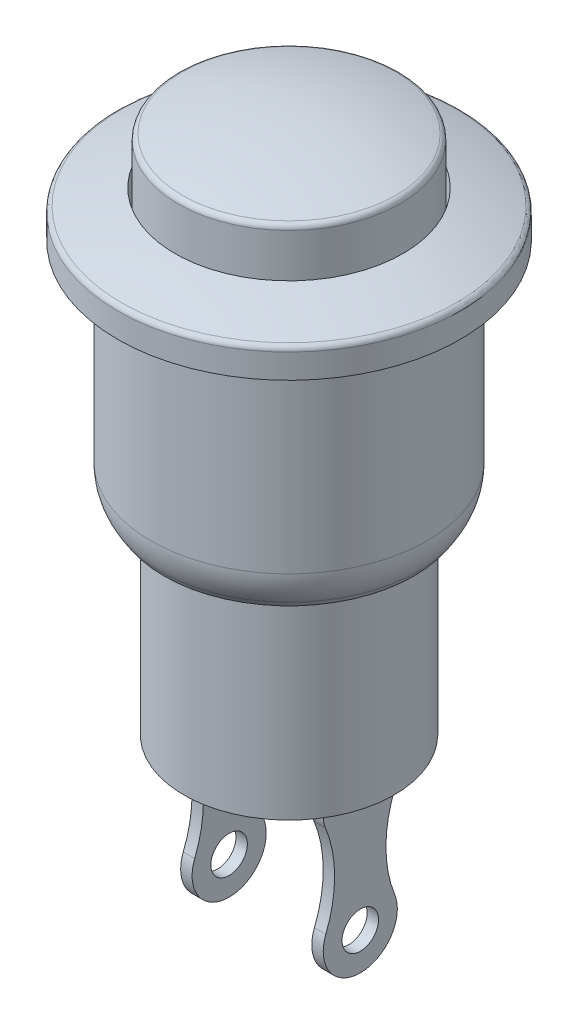
ISO-10303-21;
HEADER;
FILE_DESCRIPTION(('STEP AP214'),'2;1');
FILE_NAME('part.step','',(''),(''),'','','');
FILE_SCHEMA(('AUTOMOTIVE_DESIGN { 1 0 10303 214 1 1 1 1 }'));
ENDSEC;
DATA;
#1=APPLICATION_CONTEXT('core data for automotive mechanical design processes');
#2=APPLICATION_PROTOCOL_DEFINITION('international standard','automotive_design',2000,#1);
#3=PRODUCT_CONTEXT('',#1,'mechanical');
#4=PRODUCT('Part','Part','',(#3));
#5=PRODUCT_RELATED_PRODUCT_CATEGORY('part','',(#4));
#6=PRODUCT_DEFINITION_FORMATION('','',#4);
#7=PRODUCT_DEFINITION_CONTEXT('part definition',#1,'design');
#8=PRODUCT_DEFINITION('design','',#6,#7);
#9=PRODUCT_DEFINITION_SHAPE('','',#8);
#10=(LENGTH_UNIT() NAMED_UNIT(*) SI_UNIT(.MILLI.,.METRE.));
#11=(NAMED_UNIT(*) PLANE_ANGLE_UNIT() SI_UNIT($,.RADIAN.));
#12=(NAMED_UNIT(*) SI_UNIT($,.STERADIAN.) SOLID_ANGLE_UNIT());
#13=UNCERTAINTY_MEASURE_WITH_UNIT(LENGTH_MEASURE(1.E-05),#10,'distance_accuracy_value','');
#14=(GEOMETRIC_REPRESENTATION_CONTEXT(3) GLOBAL_UNCERTAINTY_ASSIGNED_CONTEXT((#13)) GLOBAL_UNIT_ASSIGNED_CONTEXT((#10,
#11,#12)) REPRESENTATION_CONTEXT('',''));
#15=CARTESIAN_POINT('',(0.,0.,0.));
#16=DIRECTION('',(0.,0.,1.));
#17=DIRECTION('',(1.,0.,0.));
#18=AXIS2_PLACEMENT_3D('',#15,#16,#17);
#19=CARTESIAN_POINT('',(-2.5,-6.,-1.3));
#20=DIRECTION('',(0.,0.,1.));
#21=DIRECTION('',(1.,0.,0.));
#22=AXIS2_PLACEMENT_3D('',#19,#20,#21);
#23=PLANE('',#22);
#24=DIRECTION('',(0.,1.,0.));
#25=VECTOR('',#24,1.);
#26=CARTESIAN_POINT('',(-2.1,-6.,-1.3));
#27=LINE('',#26,#25);
#28=CARTESIAN_POINT('',(-2.1,-0.59175240236366,-1.3));
#29=VERTEX_POINT('',#28);
#30=CARTESIAN_POINT('',(-2.1,0.,-1.3));
#31=VERTEX_POINT('',#30);
#32=EDGE_CURVE('E244',#29,#31,#27,.T.);
#33=ORIENTED_EDGE('',*,*,#32,.F.);
#34=DIRECTION('',(-1.,0.,0.));
#35=VECTOR('',#34,1.);
#36=CARTESIAN_POINT('',(-2.5,-0.59175240236366,-1.3));
#37=LINE('',#36,#35);
#38=CARTESIAN_POINT('',(-2.5,-0.59175240236366,-1.3));
#39=VERTEX_POINT('',#38);
#40=EDGE_CURVE('E49',#29,#39,#37,.T.);
#41=ORIENTED_EDGE('',*,*,#40,.T.);
#42=DIRECTION('',(0.,1.,0.));
#43=VECTOR('',#42,1.);
#44=CARTESIAN_POINT('',(-2.5,-6.,-1.3));
#45=LINE('',#44,#43);
#46=CARTESIAN_POINT('',(-2.5,0.,-1.3));
#47=VERTEX_POINT('',#46);
#48=EDGE_CURVE('E246',#39,#47,#45,.T.);
#49=ORIENTED_EDGE('',*,*,#48,.T.);
#50=DIRECTION('',(1.,0.,0.));
#51=VECTOR('',#50,1.);
#52=CARTESIAN_POINT('',(-2.5,0.,-1.3));
#53=LINE('',#52,#51);
#54=EDGE_CURVE('E231',#47,#31,#53,.T.);
#55=ORIENTED_EDGE('',*,*,#54,.T.);
#56=EDGE_LOOP('',(#33,#41,#49,#55));
#57=FACE_BOUND('',#56,.T.);
#58=ADVANCED_FACE('F41',(#57),#23,.F.);
#59=CARTESIAN_POINT('',(2.5,-6.,-1.3));
#60=DIRECTION('',(0.,0.,1.));
#61=DIRECTION('',(1.,0.,0.));
#62=AXIS2_PLACEMENT_3D('',#59,#60,#61);
#63=PLANE('',#62);
#64=DIRECTION('',(0.,1.,0.));
#65=VECTOR('',#64,1.);
#66=CARTESIAN_POINT('',(2.5,-6.,-1.3));
#67=LINE('',#66,#65);
#68=CARTESIAN_POINT('',(2.5,-0.59175240236366,-1.3));
#69=VERTEX_POINT('',#68);
#70=CARTESIAN_POINT('',(2.5,0.,-1.3));
#71=VERTEX_POINT('',#70);
#72=EDGE_CURVE('E222',#69,#71,#67,.T.);
#73=ORIENTED_EDGE('',*,*,#72,.F.);
#74=DIRECTION('',(-1.,0.,0.));
#75=VECTOR('',#74,1.);
#76=CARTESIAN_POINT('',(2.5,-0.59175240236366,-1.3));
#77=LINE('',#76,#75);
#78=CARTESIAN_POINT('',(2.1,-0.59175240236366,-1.3));
#79=VERTEX_POINT('',#78);
#80=EDGE_CURVE('E320',#69,#79,#77,.T.);
#81=ORIENTED_EDGE('',*,*,#80,.T.);
#82=DIRECTION('',(0.,1.,0.));
#83=VECTOR('',#82,1.);
#84=CARTESIAN_POINT('',(2.1,-6.,-1.3));
#85=LINE('',#84,#83);
#86=CARTESIAN_POINT('',(2.1,0.,-1.3));
#87=VERTEX_POINT('',#86);
#88=EDGE_CURVE('E224',#79,#87,#85,.T.);
#89=ORIENTED_EDGE('',*,*,#88,.T.);
#90=DIRECTION('',(1.,0.,0.));
#91=VECTOR('',#90,1.);
#92=CARTESIAN_POINT('',(2.5,0.,-1.3));
#93=LINE('',#92,#91);
#94=EDGE_CURVE('E214',#87,#71,#93,.T.);
#95=ORIENTED_EDGE('',*,*,#94,.T.);
#96=EDGE_LOOP('',(#73,#81,#89,#95));
#97=FACE_BOUND('',#96,.T.);
#98=ADVANCED_FACE('F358',(#97),#63,.F.);
#99=CARTESIAN_POINT('',(0.,0.,0.));
#100=DIRECTION('',(0.,-1.,0.));
#101=DIRECTION('',(0.,0.,-1.));
#102=AXIS2_PLACEMENT_3D('',#99,#100,#101);
#103=PLANE('',#102);
#104=ORIENTED_EDGE('',*,*,#54,.F.);
#105=DIRECTION('',(0.,0.,-1.));
#106=VECTOR('',#105,1.);
#107=CARTESIAN_POINT('',(-2.5,0.,1.3));
#108=LINE('',#107,#106);
#109=CARTESIAN_POINT('',(-2.5,0.,1.3));
#110=VERTEX_POINT('',#109);
#111=EDGE_CURVE('E228',#110,#47,#108,.T.);
#112=ORIENTED_EDGE('',*,*,#111,.F.);
#113=DIRECTION('',(-1.,0.,0.));
#114=VECTOR('',#113,1.);
#115=CARTESIAN_POINT('',(-2.5,0.,1.3));
#116=LINE('',#115,#114);
#117=CARTESIAN_POINT('',(-2.1,0.,1.3));
#118=VERTEX_POINT('',#117);
#119=EDGE_CURVE('E237',#118,#110,#116,.T.);
#120=ORIENTED_EDGE('',*,*,#119,.F.);
#121=DIRECTION('',(0.,0.,1.));
#122=VECTOR('',#121,1.);
#123=CARTESIAN_POINT('',(-2.1,0.,1.3));
#124=LINE('',#123,#122);
#125=EDGE_CURVE('E234',#31,#118,#124,.T.);
#126=ORIENTED_EDGE('',*,*,#125,.F.);
#127=EDGE_LOOP('',(#104,#112,#120,#126));
#128=FACE_BOUND('',#127,.T.);
#129=CARTESIAN_POINT('',(0.,0.,0.));
#130=DIRECTION('',(0.,-1.,0.));
#131=DIRECTION('',(0.,0.,-1.));
#132=AXIS2_PLACEMENT_3D('',#129,#130,#131);
#133=CIRCLE('',#132,3.69);
#134=CARTESIAN_POINT('',(0.,0.,-3.69));
#135=VERTEX_POINT('',#134);
#136=EDGE_CURVE('E257',#135,#135,#133,.T.);
#137=ORIENTED_EDGE('',*,*,#136,.T.);
#138=EDGE_LOOP('',(#137));
#139=FACE_BOUND('',#138,.T.);
#140=DIRECTION('',(0.,0.,-1.));
#141=VECTOR('',#140,1.);
#142=CARTESIAN_POINT('',(2.1,0.,1.3));
#143=LINE('',#142,#141);
#144=CARTESIAN_POINT('',(2.1,0.,1.3));
#145=VERTEX_POINT('',#144);
#146=EDGE_CURVE('E211',#145,#87,#143,.T.);
#147=ORIENTED_EDGE('',*,*,#146,.F.);
#148=DIRECTION('',(-1.,0.,0.));
#149=VECTOR('',#148,1.);
#150=CARTESIAN_POINT('',(2.5,0.,1.3));
#151=LINE('',#150,#149);
#152=CARTESIAN_POINT('',(2.5,0.,1.3));
#153=VERTEX_POINT('',#152);
#154=EDGE_CURVE('E208',#153,#145,#151,.T.);
#155=ORIENTED_EDGE('',*,*,#154,.F.);
#156=DIRECTION('',(0.,0.,1.));
#157=VECTOR('',#156,1.);
#158=CARTESIAN_POINT('',(2.5,0.,1.3));
#159=LINE('',#158,#157);
#160=EDGE_CURVE('E217',#71,#153,#159,.T.);
#161=ORIENTED_EDGE('',*,*,#160,.F.);
#162=ORIENTED_EDGE('',*,*,#94,.F.);
#163=EDGE_LOOP('',(#147,#155,#161,#162));
#164=FACE_BOUND('',#163,.T.);
#165=ADVANCED_FACE('F335',(#128,#139,#164),#103,.T.);
#166=CARTESIAN_POINT('',(0.,0.,0.));
#167=DIRECTION('',(0.,-1.,0.));
#168=DIRECTION('',(0.,0.,-1.));
#169=AXIS2_PLACEMENT_3D('',#166,#167,#168);
#170=CYLINDRICAL_SURFACE('',#169,6.01);
#171=CARTESIAN_POINT('',(0.,15.8594915447855,0.));
#172=DIRECTION('',(0.,-1.,0.));
#173=DIRECTION('',(0.,0.,-1.));
#174=AXIS2_PLACEMENT_3D('',#171,#172,#173);
#175=CIRCLE('',#174,6.01);
#176=CARTESIAN_POINT('',(0.,15.8594915447855,-6.01));
#177=VERTEX_POINT('',#176);
#178=EDGE_CURVE('E275',#177,#177,#175,.T.);
#179=ORIENTED_EDGE('',*,*,#178,.T.);
#180=EDGE_LOOP('',(#179));
#181=FACE_BOUND('',#180,.T.);
#182=CARTESIAN_POINT('',(0.,15.,0.));
#183=DIRECTION('',(0.,-1.,0.));
#184=DIRECTION('',(0.,0.,-1.));
#185=AXIS2_PLACEMENT_3D('',#182,#183,#184);
#186=CIRCLE('',#185,6.01);
#187=CARTESIAN_POINT('',(0.,15.,-6.01));
#188=VERTEX_POINT('',#187);
#189=EDGE_CURVE('E248',#188,#188,#186,.T.);
#190=ORIENTED_EDGE('',*,*,#189,.F.);
#191=EDGE_LOOP('',(#190));
#192=FACE_BOUND('',#191,.T.);
#193=ADVANCED_FACE('F390',(#181,#192),#170,.T.);
#194=CARTESIAN_POINT('',(0.,-0.466749999999985,0.));
#195=DIRECTION('',(0.,-1.,0.));
#196=DIRECTION('',(1.,0.,0.));
#197=AXIS2_PLACEMENT_3D('',#194,#195,#196);
#198=SPHERICAL_SURFACE('',#197,17.5292314595506);
#199=CARTESIAN_POINT('',(0.,16.0479158448809,0.));
#200=DIRECTION('',(0.,-1.,0.));
#201=DIRECTION('',(0.,0.,-1.));
#202=AXIS2_PLACEMENT_3D('',#199,#200,#201);
#203=CIRCLE('',#202,5.87705432971521);
#204=CARTESIAN_POINT('',(0.,16.0479158448809,-5.87705432971521));
#205=VERTEX_POINT('',#204);
#206=EDGE_CURVE('E278',#205,#205,#203,.F.);
#207=ORIENTED_EDGE('',*,*,#206,.T.);
#208=EDGE_LOOP('',(#207));
#209=FACE_BOUND('',#208,.T.);
#210=CARTESIAN_POINT('',(0.,16.6,0.));
#211=DIRECTION('',(0.,-1.,0.));
#212=DIRECTION('',(0.,0.,-1.));
#213=AXIS2_PLACEMENT_3D('',#210,#211,#212);
#214=CIRCLE('',#213,4.);
#215=CARTESIAN_POINT('',(0.,16.6,-4.));
#216=VERTEX_POINT('',#215);
#217=EDGE_CURVE('E266',#216,#216,#214,.T.);
#218=ORIENTED_EDGE('',*,*,#217,.T.);
#219=EDGE_LOOP('',(#218));
#220=FACE_BOUND('',#219,.T.);
#221=ADVANCED_FACE('F405',(#209,#220),#198,.T.);
#222=CARTESIAN_POINT('',(0.,0.,0.));
#223=DIRECTION('',(0.,-1.,0.));
#224=DIRECTION('',(0.,0.,-1.));
#225=AXIS2_PLACEMENT_3D('',#222,#223,#224);
#226=CYLINDRICAL_SURFACE('',#225,4.);
#227=CARTESIAN_POINT('',(0.,15.0131906379404,0.));
#228=DIRECTION('',(0.,-1.,0.));
#229=DIRECTION('',(0.,0.,-1.));
#230=AXIS2_PLACEMENT_3D('',#227,#228,#229);
#231=CIRCLE('',#230,4.);
#232=CARTESIAN_POINT('',(0.,15.0131906379404,-4.));
#233=VERTEX_POINT('',#232);
#234=EDGE_CURVE('E263',#233,#233,#231,.T.);
#235=ORIENTED_EDGE('',*,*,#234,.T.);
#236=EDGE_LOOP('',(#235));
#237=FACE_BOUND('',#236,.T.);
#238=ORIENTED_EDGE('',*,*,#217,.F.);
#239=EDGE_LOOP('',(#238));
#240=FACE_BOUND('',#239,.T.);
#241=ADVANCED_FACE('F401',(#237,#240),#226,.F.);
#242=CARTESIAN_POINT('',(0.,15.0131906379404,0.));
#243=DIRECTION('',(0.,1.,0.));
#244=DIRECTION('',(0.,0.,1.));
#245=AXIS2_PLACEMENT_3D('',#242,#243,#244);
#246=PLANE('',#245);
#247=CARTESIAN_POINT('',(0.,15.0131906379404,0.));
#248=DIRECTION('',(0.,-1.,0.));
#249=DIRECTION('',(0.,0.,-1.));
#250=AXIS2_PLACEMENT_3D('',#247,#248,#249);
#251=CIRCLE('',#250,3.89);
#252=CARTESIAN_POINT('',(0.,15.0131906379404,-3.89));
#253=VERTEX_POINT('',#252);
#254=EDGE_CURVE('E260',#253,#253,#251,.T.);
#255=ORIENTED_EDGE('',*,*,#254,.T.);
#256=EDGE_LOOP('',(#255));
#257=FACE_BOUND('',#256,.T.);
#258=ORIENTED_EDGE('',*,*,#234,.F.);
#259=EDGE_LOOP('',(#258));
#260=FACE_BOUND('',#259,.T.);
#261=ADVANCED_FACE('F397',(#257,#260),#246,.T.);
#262=CARTESIAN_POINT('',(0.,0.,0.));
#263=DIRECTION('',(0.,-1.,0.));
#264=DIRECTION('',(0.,0.,-1.));
#265=AXIS2_PLACEMENT_3D('',#262,#263,#264);
#266=CYLINDRICAL_SURFACE('',#265,3.89);
#267=CARTESIAN_POINT('',(0.,18.0525692696262,0.));
#268=DIRECTION('',(0.,-1.,0.));
#269=DIRECTION('',(0.,0.,-1.));
#270=AXIS2_PLACEMENT_3D('',#267,#268,#269);
#271=CIRCLE('',#270,3.89);
#272=CARTESIAN_POINT('',(0.,18.0525692696262,-3.89));
#273=VERTEX_POINT('',#272);
#274=EDGE_CURVE('E269',#273,#273,#271,.T.);
#275=ORIENTED_EDGE('',*,*,#274,.T.);
#276=EDGE_LOOP('',(#275));
#277=FACE_BOUND('',#276,.T.);
#278=ORIENTED_EDGE('',*,*,#254,.F.);
#279=EDGE_LOOP('',(#278));
#280=FACE_BOUND('',#279,.T.);
#281=ADVANCED_FACE('F393',(#277,#280),#266,.T.);
#282=CARTESIAN_POINT('',(0.,5.88991666666667,0.));
#283=DIRECTION('',(0.,-1.,0.));
#284=DIRECTION('',(1.,0.,0.));
#285=AXIS2_PLACEMENT_3D('',#282,#283,#284);
#286=SPHERICAL_SURFACE('',#285,12.9100833333333);
#287=CARTESIAN_POINT('',(0.,18.2439551525348,0.));
#288=DIRECTION('',(0.,-1.,0.));
#289=DIRECTION('',(0.,0.,-1.));
#290=AXIS2_PLACEMENT_3D('',#287,#288,#289);
#291=CIRCLE('',#290,3.74806413543053);
#292=CARTESIAN_POINT('',(0.,18.2439551525348,-3.74806413543053));
#293=VERTEX_POINT('',#292);
#294=EDGE_CURVE('E272',#293,#293,#291,.F.);
#295=ORIENTED_EDGE('',*,*,#294,.T.);
#296=EDGE_LOOP('',(#295));
#297=FACE_BOUND('',#296,.T.);
#298=ADVANCED_FACE('F386',(#297),#286,.T.);
#299=CARTESIAN_POINT('',(0.,0.,0.));
#300=DIRECTION('',(0.,-1.,0.));
#301=DIRECTION('',(0.,0.,-1.));
#302=AXIS2_PLACEMENT_3D('',#299,#300,#301);
#303=CYLINDRICAL_SURFACE('',#302,3.69);
#304=CARTESIAN_POINT('',(0.,7.,0.));
#305=DIRECTION('',(0.,-1.,0.));
#306=DIRECTION('',(0.,0.,-1.));
#307=AXIS2_PLACEMENT_3D('',#304,#305,#306);
#308=CIRCLE('',#307,3.69);
#309=CARTESIAN_POINT('',(0.,7.,-3.69));
#310=VERTEX_POINT('',#309);
#311=EDGE_CURVE('E254',#310,#310,#308,.T.);
#312=ORIENTED_EDGE('',*,*,#311,.T.);
#313=EDGE_LOOP('',(#312));
#314=FACE_BOUND('',#313,.T.);
#315=ORIENTED_EDGE('',*,*,#136,.F.);
#316=EDGE_LOOP('',(#315));
#317=FACE_BOUND('',#316,.T.);
#318=ADVANCED_FACE('F382',(#314,#317),#303,.T.);
#319=CARTESIAN_POINT('',(0.,7.,0.));
#320=DIRECTION('',(0.,-1.,0.));
#321=DIRECTION('',(0.,0.,-1.));
#322=AXIS2_PLACEMENT_3D('',#319,#320,#321);
#323=PLANE('',#322);
#324=CARTESIAN_POINT('',(0.,7.,0.));
#325=DIRECTION('',(0.,-1.,0.));
#326=DIRECTION('',(0.,0.,-1.));
#327=AXIS2_PLACEMENT_3D('',#324,#325,#326);
#328=CIRCLE('',#327,4.38541468476175);
#329=CARTESIAN_POINT('',(0.,7.,-4.38541468476175));
#330=VERTEX_POINT('',#329);
#331=EDGE_CURVE('E281',#330,#330,#328,.T.);
#332=ORIENTED_EDGE('',*,*,#331,.T.);
#333=EDGE_LOOP('',(#332));
#334=FACE_BOUND('',#333,.T.);
#335=ORIENTED_EDGE('',*,*,#311,.F.);
#336=EDGE_LOOP('',(#335));
#337=FACE_BOUND('',#336,.T.);
#338=ADVANCED_FACE('F378',(#334,#337),#323,.T.);
#339=CARTESIAN_POINT('',(0.,0.,0.));
#340=DIRECTION('',(0.,-1.,0.));
#341=DIRECTION('',(0.,0.,-1.));
#342=AXIS2_PLACEMENT_3D('',#339,#340,#341);
#343=CYLINDRICAL_SURFACE('',#342,4.84);
#344=CARTESIAN_POINT('',(0.,8.29242698992415,0.));
#345=DIRECTION('',(0.,-1.,0.));
#346=DIRECTION('',(0.,0.,-1.));
#347=AXIS2_PLACEMENT_3D('',#344,#345,#346);
#348=CIRCLE('',#347,4.84);
#349=CARTESIAN_POINT('',(0.,8.29242698992415,-4.84));
#350=VERTEX_POINT('',#349);
#351=EDGE_CURVE('E284',#350,#350,#348,.F.);
#352=ORIENTED_EDGE('',*,*,#351,.T.);
#353=EDGE_LOOP('',(#352));
#354=FACE_BOUND('',#353,.T.);
#355=CARTESIAN_POINT('',(0.,15.,0.));
#356=DIRECTION('',(0.,-1.,0.));
#357=DIRECTION('',(0.,0.,-1.));
#358=AXIS2_PLACEMENT_3D('',#355,#356,#357);
#359=CIRCLE('',#358,4.84);
#360=CARTESIAN_POINT('',(0.,15.,-4.84));
#361=VERTEX_POINT('',#360);
#362=EDGE_CURVE('E251',#361,#361,#359,.T.);
#363=ORIENTED_EDGE('',*,*,#362,.T.);
#364=EDGE_LOOP('',(#363));
#365=FACE_BOUND('',#364,.T.);
#366=ADVANCED_FACE('F374',(#354,#365),#343,.T.);
#367=CARTESIAN_POINT('',(0.,15.,0.));
#368=DIRECTION('',(0.,-1.,0.));
#369=DIRECTION('',(0.,0.,-1.));
#370=AXIS2_PLACEMENT_3D('',#367,#368,#369);
#371=PLANE('',#370);
#372=ORIENTED_EDGE('',*,*,#189,.T.);
#373=EDGE_LOOP('',(#372));
#374=FACE_BOUND('',#373,.T.);
#375=ORIENTED_EDGE('',*,*,#362,.F.);
#376=EDGE_LOOP('',(#375));
#377=FACE_BOUND('',#376,.T.);
#378=ADVANCED_FACE('F370',(#374,#377),#371,.T.);
#379=CARTESIAN_POINT('',(0.,18.0525692696262,0.));
#380=DIRECTION('',(0.,-1.,0.));
#381=DIRECTION('',(0.,0.,-1.));
#382=AXIS2_PLACEMENT_3D('',#379,#380,#381);
#383=TOROIDAL_SURFACE('',#382,3.69,0.2);
#384=ORIENTED_EDGE('',*,*,#294,.F.);
#385=EDGE_LOOP('',(#384));
#386=FACE_BOUND('',#385,.T.);
#387=ORIENTED_EDGE('',*,*,#274,.F.);
#388=EDGE_LOOP('',(#387));
#389=FACE_BOUND('',#388,.T.);
#390=ADVANCED_FACE('F373',(#386,#389),#383,.T.);
#391=CARTESIAN_POINT('',(0.,15.8594915447855,0.));
#392=DIRECTION('',(0.,-1.,0.));
#393=DIRECTION('',(0.,0.,-1.));
#394=AXIS2_PLACEMENT_3D('',#391,#392,#393);
#395=TOROIDAL_SURFACE('',#394,5.81,0.2);
#396=ORIENTED_EDGE('',*,*,#206,.F.);
#397=EDGE_LOOP('',(#396));
#398=FACE_BOUND('',#397,.T.);
#399=ORIENTED_EDGE('',*,*,#178,.F.);
#400=EDGE_LOOP('',(#399));
#401=FACE_BOUND('',#400,.T.);
#402=ADVANCED_FACE('F415',(#398,#401),#395,.T.);
#403=CARTESIAN_POINT('',(0.,7.,0.));
#404=DIRECTION('',(0.,1.,0.));
#405=DIRECTION('',(0.,0.,1.));
#406=AXIS2_PLACEMENT_3D('',#403,#404,#405);
#407=CONICAL_SURFACE('',#406,4.38541468476175,0.575958653158124);
#408=CARTESIAN_POINT('',(0.,7.2031489198941,0.));
#409=DIRECTION('',(0.,-1.,0.));
#410=DIRECTION('',(0.,0.,-1.));
#411=AXIS2_PLACEMENT_3D('',#408,#409,#410);
#412=CIRCLE('',#411,4.51734113589085);
#413=CARTESIAN_POINT('',(0.,7.2031489198941,-4.51734113589085));
#414=VERTEX_POINT('',#413);
#415=EDGE_CURVE('E287',#414,#414,#412,.T.);
#416=ORIENTED_EDGE('',*,*,#415,.T.);
#417=EDGE_LOOP('',(#416));
#418=FACE_BOUND('',#417,.T.);
#419=ORIENTED_EDGE('',*,*,#331,.F.);
#420=EDGE_LOOP('',(#419));
#421=FACE_BOUND('',#420,.T.);
#422=ADVANCED_FACE('F419',(#418,#421),#407,.T.);
#423=CARTESIAN_POINT('',(0.,8.29242698992415,0.));
#424=DIRECTION('',(0.,-1.,0.));
#425=DIRECTION('',(0.,0.,-1.));
#426=AXIS2_PLACEMENT_3D('',#423,#424,#425);
#427=TOROIDAL_SURFACE('',#426,2.84,2.);
#428=ORIENTED_EDGE('',*,*,#415,.F.);
#429=EDGE_LOOP('',(#428));
#430=FACE_BOUND('',#429,.T.);
#431=ORIENTED_EDGE('',*,*,#351,.F.);
#432=EDGE_LOOP('',(#431));
#433=FACE_BOUND('',#432,.T.);
#434=ADVANCED_FACE('F368',(#430,#433),#427,.T.);
#435=CARTESIAN_POINT('',(-2.5,-6.,1.3));
#436=DIRECTION('',(1.,0.,0.));
#437=DIRECTION('',(0.,0.,-1.));
#438=AXIS2_PLACEMENT_3D('',#435,#436,#437);
#439=PLANE('',#438);
#440=CARTESIAN_POINT('',(-2.5,-4.7,0.));
#441=DIRECTION('',(-1.,0.,0.));
#442=DIRECTION('',(0.,0.,1.));
#443=AXIS2_PLACEMENT_3D('',#440,#441,#442);
#444=CIRCLE('',#443,0.64);
#445=CARTESIAN_POINT('',(-2.5,-4.7,0.64));
#446=VERTEX_POINT('',#445);
#447=EDGE_CURVE('E198',#446,#446,#444,.T.);
#448=ORIENTED_EDGE('',*,*,#447,.F.);
#449=EDGE_LOOP('',(#448));
#450=FACE_BOUND('',#449,.T.);
#451=CARTESIAN_POINT('',(-2.5,-2.61666666666667,5.22534722222222));
#452=DIRECTION('',(-1.,0.,0.));
#453=DIRECTION('',(0.,0.,-1.));
#454=AXIS2_PLACEMENT_3D('',#451,#452,#453);
#455=CIRCLE('',#454,4.32534722222222);
#456=CARTESIAN_POINT('',(-2.5,-0.971993197903382,1.22488752689574));
#457=VERTEX_POINT('',#456);
#458=CARTESIAN_POINT('',(-2.5,-4.2185482377631,1.20756126165052));
#459=VERTEX_POINT('',#458);
#460=EDGE_CURVE('E155',#457,#459,#455,.T.);
#461=ORIENTED_EDGE('',*,*,#460,.F.);
#462=CARTESIAN_POINT('',(-2.5,-0.591752402363664,0.299999999999999));
#463=DIRECTION('',(1.,0.,0.));
#464=DIRECTION('',(0.,0.,-1.));
#465=AXIS2_PLACEMENT_3D('',#462,#463,#464);
#466=CIRCLE('',#465,1.);
#467=CARTESIAN_POINT('',(-2.5,-0.591752402363664,1.3));
#468=VERTEX_POINT('',#467);
#469=EDGE_CURVE('E313',#457,#468,#466,.F.);
#470=ORIENTED_EDGE('',*,*,#469,.T.);
#471=DIRECTION('',(0.,1.,0.));
#472=VECTOR('',#471,1.);
#473=CARTESIAN_POINT('',(-2.5,-6.,1.3));
#474=LINE('',#473,#472);
#475=EDGE_CURVE('E240',#468,#110,#474,.T.);
#476=ORIENTED_EDGE('',*,*,#475,.T.);
#477=ORIENTED_EDGE('',*,*,#111,.T.);
#478=ORIENTED_EDGE('',*,*,#48,.F.);
#479=CARTESIAN_POINT('',(-2.5,-0.59175240236366,-0.300000000000001));
#480=DIRECTION('',(1.,0.,0.));
#481=DIRECTION('',(0.,0.,-1.));
#482=AXIS2_PLACEMENT_3D('',#479,#480,#481);
#483=CIRCLE('',#482,1.);
#484=CARTESIAN_POINT('',(-2.5,-0.971993197903378,-1.22488752689574));
#485=VERTEX_POINT('',#484);
#486=EDGE_CURVE('E311',#39,#485,#483,.F.);
#487=ORIENTED_EDGE('',*,*,#486,.T.);
#488=CARTESIAN_POINT('',(-2.5,-2.61666666666667,-5.22534722222222));
#489=DIRECTION('',(-1.,0.,0.));
#490=DIRECTION('',(0.,0.,1.));
#491=AXIS2_PLACEMENT_3D('',#488,#489,#490);
#492=CIRCLE('',#491,4.32534722222222);
#493=CARTESIAN_POINT('',(-2.5,-4.2185482377631,-1.20756126165051));
#494=VERTEX_POINT('',#493);
#495=EDGE_CURVE('E169',#494,#485,#492,.T.);
#496=ORIENTED_EDGE('',*,*,#495,.F.);
#497=CARTESIAN_POINT('',(-2.5,-4.7,0.));
#498=DIRECTION('',(1.,0.,0.));
#499=DIRECTION('',(0.,0.,1.));
#500=AXIS2_PLACEMENT_3D('',#497,#498,#499);
#501=CIRCLE('',#500,1.3);
#502=EDGE_CURVE('E164',#459,#494,#501,.T.);
#503=ORIENTED_EDGE('',*,*,#502,.F.);
#504=EDGE_LOOP('',(#461,#470,#476,#477,#478,#487,#496,#503));
#505=FACE_BOUND('',#504,.T.);
#506=ADVANCED_FACE('F168',(#450,#505),#439,.F.);
#507=CARTESIAN_POINT('',(-2.1,-6.,1.3));
#508=DIRECTION('',(-1.,0.,0.));
#509=DIRECTION('',(0.,0.,1.));
#510=AXIS2_PLACEMENT_3D('',#507,#508,#509);
#511=PLANE('',#510);
#512=CARTESIAN_POINT('',(-2.1,-4.7,0.));
#513=DIRECTION('',(-1.,0.,0.));
#514=DIRECTION('',(0.,0.,1.));
#515=AXIS2_PLACEMENT_3D('',#512,#513,#514);
#516=CIRCLE('',#515,0.64);
#517=CARTESIAN_POINT('',(-2.1,-4.7,0.64));
#518=VERTEX_POINT('',#517);
#519=EDGE_CURVE('E205',#518,#518,#516,.T.);
#520=ORIENTED_EDGE('',*,*,#519,.T.);
#521=EDGE_LOOP('',(#520));
#522=FACE_BOUND('',#521,.T.);
#523=DIRECTION('',(0.,1.,0.));
#524=VECTOR('',#523,1.);
#525=CARTESIAN_POINT('',(-2.1,-6.,1.3));
#526=LINE('',#525,#524);
#527=CARTESIAN_POINT('',(-2.1,-0.591752402363664,1.3));
#528=VERTEX_POINT('',#527);
#529=EDGE_CURVE('E242',#528,#118,#526,.T.);
#530=ORIENTED_EDGE('',*,*,#529,.F.);
#531=CARTESIAN_POINT('',(-2.1,-0.591752402363664,0.299999999999999));
#532=DIRECTION('',(-1.,0.,0.));
#533=DIRECTION('',(0.,0.,1.));
#534=AXIS2_PLACEMENT_3D('',#531,#532,#533);
#535=CIRCLE('',#534,1.);
#536=CARTESIAN_POINT('',(-2.1,-0.971993197903382,1.22488752689574));
#537=VERTEX_POINT('',#536);
#538=EDGE_CURVE('E318',#528,#537,#535,.F.);
#539=ORIENTED_EDGE('',*,*,#538,.T.);
#540=CARTESIAN_POINT('',(-2.1,-2.61666666666667,5.22534722222222));
#541=DIRECTION('',(-1.,0.,0.));
#542=DIRECTION('',(0.,0.,1.));
#543=AXIS2_PLACEMENT_3D('',#540,#541,#542);
#544=CIRCLE('',#543,4.32534722222222);
#545=CARTESIAN_POINT('',(-2.1,-4.2185482377631,1.20756126165052));
#546=VERTEX_POINT('',#545);
#547=EDGE_CURVE('E196',#537,#546,#544,.T.);
#548=ORIENTED_EDGE('',*,*,#547,.T.);
#549=CARTESIAN_POINT('',(-2.1,-4.7,0.));
#550=DIRECTION('',(-1.,0.,0.));
#551=DIRECTION('',(0.,0.,1.));
#552=AXIS2_PLACEMENT_3D('',#549,#550,#551);
#553=CIRCLE('',#552,1.3);
#554=CARTESIAN_POINT('',(-2.1,-4.2185482377631,-1.20756126165051));
#555=VERTEX_POINT('',#554);
#556=EDGE_CURVE('E175',#546,#555,#553,.F.);
#557=ORIENTED_EDGE('',*,*,#556,.T.);
#558=CARTESIAN_POINT('',(-2.1,-2.61666666666667,-5.22534722222222));
#559=DIRECTION('',(-1.,0.,0.));
#560=DIRECTION('',(0.,0.,1.));
#561=AXIS2_PLACEMENT_3D('',#558,#559,#560);
#562=CIRCLE('',#561,4.32534722222222);
#563=CARTESIAN_POINT('',(-2.1,-0.971993197903378,-1.22488752689574));
#564=VERTEX_POINT('',#563);
#565=EDGE_CURVE('E191',#555,#564,#562,.T.);
#566=ORIENTED_EDGE('',*,*,#565,.T.);
#567=CARTESIAN_POINT('',(-2.1,-0.59175240236366,-0.300000000000001));
#568=DIRECTION('',(-1.,0.,0.));
#569=DIRECTION('',(0.,0.,1.));
#570=AXIS2_PLACEMENT_3D('',#567,#568,#569);
#571=CIRCLE('',#570,1.);
#572=EDGE_CURVE('E56',#564,#29,#571,.F.);
#573=ORIENTED_EDGE('',*,*,#572,.T.);
#574=ORIENTED_EDGE('',*,*,#32,.T.);
#575=ORIENTED_EDGE('',*,*,#125,.T.);
#576=EDGE_LOOP('',(#530,#539,#548,#557,#566,#573,#574,#575));
#577=FACE_BOUND('',#576,.T.);
#578=ADVANCED_FACE('F338',(#522,#577),#511,.F.);
#579=CARTESIAN_POINT('',(-2.5,-6.,1.3));
#580=DIRECTION('',(0.,0.,-1.));
#581=DIRECTION('',(-1.,0.,0.));
#582=AXIS2_PLACEMENT_3D('',#579,#580,#581);
#583=PLANE('',#582);
#584=ORIENTED_EDGE('',*,*,#475,.F.);
#585=DIRECTION('',(-1.,0.,0.));
#586=VECTOR('',#585,1.);
#587=CARTESIAN_POINT('',(-2.5,-0.591752402363664,1.3));
#588=LINE('',#587,#586);
#589=EDGE_CURVE('E315',#468,#528,#588,.F.);
#590=ORIENTED_EDGE('',*,*,#589,.T.);
#591=ORIENTED_EDGE('',*,*,#529,.T.);
#592=ORIENTED_EDGE('',*,*,#119,.T.);
#593=EDGE_LOOP('',(#584,#590,#591,#592));
#594=FACE_BOUND('',#593,.T.);
#595=ADVANCED_FACE('F344',(#594),#583,.F.);
#596=CARTESIAN_POINT('',(2.5,-6.,1.3));
#597=DIRECTION('',(0.,0.,-1.));
#598=DIRECTION('',(-1.,0.,0.));
#599=AXIS2_PLACEMENT_3D('',#596,#597,#598);
#600=PLANE('',#599);
#601=DIRECTION('',(0.,1.,0.));
#602=VECTOR('',#601,1.);
#603=CARTESIAN_POINT('',(2.1,-6.,1.3));
#604=LINE('',#603,#602);
#605=CARTESIAN_POINT('',(2.1,-0.591752402363664,1.3));
#606=VERTEX_POINT('',#605);
#607=EDGE_CURVE('E226',#606,#145,#604,.T.);
#608=ORIENTED_EDGE('',*,*,#607,.F.);
#609=DIRECTION('',(-1.,0.,0.));
#610=VECTOR('',#609,1.);
#611=CARTESIAN_POINT('',(2.5,-0.591752402363664,1.3));
#612=LINE('',#611,#610);
#613=CARTESIAN_POINT('',(2.5,-0.591752402363664,1.3));
#614=VERTEX_POINT('',#613);
#615=EDGE_CURVE('E304',#606,#614,#612,.F.);
#616=ORIENTED_EDGE('',*,*,#615,.T.);
#617=DIRECTION('',(0.,1.,0.));
#618=VECTOR('',#617,1.);
#619=CARTESIAN_POINT('',(2.5,-6.,1.3));
#620=LINE('',#619,#618);
#621=EDGE_CURVE('E220',#614,#153,#620,.T.);
#622=ORIENTED_EDGE('',*,*,#621,.T.);
#623=ORIENTED_EDGE('',*,*,#154,.T.);
#624=EDGE_LOOP('',(#608,#616,#622,#623));
#625=FACE_BOUND('',#624,.T.);
#626=ADVANCED_FACE('F346',(#625),#600,.F.);
#627=CARTESIAN_POINT('',(2.1,-6.,1.3));
#628=DIRECTION('',(1.,0.,0.));
#629=DIRECTION('',(0.,0.,-1.));
#630=AXIS2_PLACEMENT_3D('',#627,#628,#629);
#631=PLANE('',#630);
#632=CARTESIAN_POINT('',(2.1,-4.7,0.));
#633=DIRECTION('',(1.,0.,0.));
#634=DIRECTION('',(0.,0.,-1.));
#635=AXIS2_PLACEMENT_3D('',#632,#633,#634);
#636=CIRCLE('',#635,0.64);
#637=CARTESIAN_POINT('',(2.1,-4.7,-0.639999999999999));
#638=VERTEX_POINT('',#637);
#639=EDGE_CURVE('E202',#638,#638,#636,.T.);
#640=ORIENTED_EDGE('',*,*,#639,.T.);
#641=EDGE_LOOP('',(#640));
#642=FACE_BOUND('',#641,.T.);
#643=CARTESIAN_POINT('',(2.1,-2.61666666666667,5.22534722222222));
#644=DIRECTION('',(1.,0.,0.));
#645=DIRECTION('',(0.,0.,-1.));
#646=AXIS2_PLACEMENT_3D('',#643,#644,#645);
#647=CIRCLE('',#646,4.32534722222222);
#648=CARTESIAN_POINT('',(2.1,-4.2185482377631,1.20756126165052));
#649=VERTEX_POINT('',#648);
#650=CARTESIAN_POINT('',(2.1,-0.971993197903382,1.22488752689574));
#651=VERTEX_POINT('',#650);
#652=EDGE_CURVE('E193',#649,#651,#647,.T.);
#653=ORIENTED_EDGE('',*,*,#652,.T.);
#654=CARTESIAN_POINT('',(2.1,-0.591752402363664,0.3));
#655=DIRECTION('',(1.,0.,0.));
#656=DIRECTION('',(0.,0.,-1.));
#657=AXIS2_PLACEMENT_3D('',#654,#655,#656);
#658=CIRCLE('',#657,1.);
#659=EDGE_CURVE('E302',#651,#606,#658,.F.);
#660=ORIENTED_EDGE('',*,*,#659,.T.);
#661=ORIENTED_EDGE('',*,*,#607,.T.);
#662=ORIENTED_EDGE('',*,*,#146,.T.);
#663=ORIENTED_EDGE('',*,*,#88,.F.);
#664=CARTESIAN_POINT('',(2.1,-0.59175240236366,-0.3));
#665=DIRECTION('',(1.,0.,0.));
#666=DIRECTION('',(0.,0.,-1.));
#667=AXIS2_PLACEMENT_3D('',#664,#665,#666);
#668=CIRCLE('',#667,1.);
#669=CARTESIAN_POINT('',(2.1,-0.971993197903378,-1.22488752689574));
#670=VERTEX_POINT('',#669);
#671=EDGE_CURVE('E300',#79,#670,#668,.F.);
#672=ORIENTED_EDGE('',*,*,#671,.T.);
#673=CARTESIAN_POINT('',(2.1,-2.61666666666667,-5.22534722222222));
#674=DIRECTION('',(1.,0.,0.));
#675=DIRECTION('',(0.,0.,-1.));
#676=AXIS2_PLACEMENT_3D('',#673,#674,#675);
#677=CIRCLE('',#676,4.32534722222222);
#678=CARTESIAN_POINT('',(2.1,-4.2185482377631,-1.20756126165051));
#679=VERTEX_POINT('',#678);
#680=EDGE_CURVE('E189',#670,#679,#677,.T.);
#681=ORIENTED_EDGE('',*,*,#680,.T.);
#682=CARTESIAN_POINT('',(2.1,-4.7,0.));
#683=DIRECTION('',(1.,0.,0.));
#684=DIRECTION('',(0.,0.,-1.));
#685=AXIS2_PLACEMENT_3D('',#682,#683,#684);
#686=CIRCLE('',#685,1.3);
#687=EDGE_CURVE('E185',#679,#649,#686,.F.);
#688=ORIENTED_EDGE('',*,*,#687,.T.);
#689=EDGE_LOOP('',(#653,#660,#661,#662,#663,#672,#681,#688));
#690=FACE_BOUND('',#689,.T.);
#691=ADVANCED_FACE('F352',(#642,#690),#631,.F.);
#692=CARTESIAN_POINT('',(2.5,-6.,1.3));
#693=DIRECTION('',(-1.,0.,0.));
#694=DIRECTION('',(0.,0.,1.));
#695=AXIS2_PLACEMENT_3D('',#692,#693,#694);
#696=PLANE('',#695);
#697=CARTESIAN_POINT('',(2.5,-4.7,0.));
#698=DIRECTION('',(-1.,0.,0.));
#699=DIRECTION('',(0.,0.,1.));
#700=AXIS2_PLACEMENT_3D('',#697,#698,#699);
#701=CIRCLE('',#700,0.64);
#702=CARTESIAN_POINT('',(2.5,-4.7,0.640000000000001));
#703=VERTEX_POINT('',#702);
#704=EDGE_CURVE('E201',#703,#703,#701,.T.);
#705=ORIENTED_EDGE('',*,*,#704,.T.);
#706=EDGE_LOOP('',(#705));
#707=FACE_BOUND('',#706,.T.);
#708=ORIENTED_EDGE('',*,*,#621,.F.);
#709=CARTESIAN_POINT('',(2.5,-0.591752402363664,0.3));
#710=DIRECTION('',(-1.,0.,0.));
#711=DIRECTION('',(0.,0.,1.));
#712=AXIS2_PLACEMENT_3D('',#709,#710,#711);
#713=CIRCLE('',#712,1.);
#714=CARTESIAN_POINT('',(2.5,-0.971993197903382,1.22488752689574));
#715=VERTEX_POINT('',#714);
#716=EDGE_CURVE('E308',#614,#715,#713,.F.);
#717=ORIENTED_EDGE('',*,*,#716,.T.);
#718=CARTESIAN_POINT('',(2.5,-2.61666666666667,5.22534722222222));
#719=DIRECTION('',(-1.,0.,0.));
#720=DIRECTION('',(0.,0.,1.));
#721=AXIS2_PLACEMENT_3D('',#718,#719,#720);
#722=CIRCLE('',#721,4.32534722222222);
#723=CARTESIAN_POINT('',(2.5,-4.2185482377631,1.20756126165052));
#724=VERTEX_POINT('',#723);
#725=EDGE_CURVE('E295',#715,#724,#722,.T.);
#726=ORIENTED_EDGE('',*,*,#725,.T.);
#727=CARTESIAN_POINT('',(2.5,-4.7,0.));
#728=DIRECTION('',(-1.,0.,0.));
#729=DIRECTION('',(0.,0.,1.));
#730=AXIS2_PLACEMENT_3D('',#727,#728,#729);
#731=CIRCLE('',#730,1.3);
#732=CARTESIAN_POINT('',(2.5,-4.2185482377631,-1.20756126165051));
#733=VERTEX_POINT('',#732);
#734=EDGE_CURVE('E183',#724,#733,#731,.F.);
#735=ORIENTED_EDGE('',*,*,#734,.T.);
#736=CARTESIAN_POINT('',(2.5,-2.61666666666667,-5.22534722222222));
#737=DIRECTION('',(-1.,0.,0.));
#738=DIRECTION('',(0.,0.,1.));
#739=AXIS2_PLACEMENT_3D('',#736,#737,#738);
#740=CIRCLE('',#739,4.32534722222222);
#741=CARTESIAN_POINT('',(2.5,-0.971993197903378,-1.22488752689574));
#742=VERTEX_POINT('',#741);
#743=EDGE_CURVE('E290',#733,#742,#740,.T.);
#744=ORIENTED_EDGE('',*,*,#743,.T.);
#745=CARTESIAN_POINT('',(2.5,-0.59175240236366,-0.3));
#746=DIRECTION('',(-1.,0.,0.));
#747=DIRECTION('',(0.,0.,1.));
#748=AXIS2_PLACEMENT_3D('',#745,#746,#747);
#749=CIRCLE('',#748,1.);
#750=EDGE_CURVE('E306',#742,#69,#749,.F.);
#751=ORIENTED_EDGE('',*,*,#750,.T.);
#752=ORIENTED_EDGE('',*,*,#72,.T.);
#753=ORIENTED_EDGE('',*,*,#160,.T.);
#754=EDGE_LOOP('',(#708,#717,#726,#735,#744,#751,#752,#753));
#755=FACE_BOUND('',#754,.T.);
#756=ADVANCED_FACE('F444',(#707,#755),#696,.F.);
#757=CARTESIAN_POINT('',(3.5,-4.7,0.));
#758=DIRECTION('',(-1.,0.,0.));
#759=DIRECTION('',(0.,0.,1.));
#760=AXIS2_PLACEMENT_3D('',#757,#758,#759);
#761=CYLINDRICAL_SURFACE('',#760,0.64);
#762=ORIENTED_EDGE('',*,*,#704,.F.);
#763=EDGE_LOOP('',(#762));
#764=FACE_BOUND('',#763,.T.);
#765=ORIENTED_EDGE('',*,*,#639,.F.);
#766=EDGE_LOOP('',(#765));
#767=FACE_BOUND('',#766,.T.);
#768=ADVANCED_FACE('F489',(#764,#767),#761,.F.);
#769=ORIENTED_EDGE('',*,*,#447,.T.);
#770=EDGE_LOOP('',(#769));
#771=FACE_BOUND('',#770,.T.);
#772=ORIENTED_EDGE('',*,*,#519,.F.);
#773=EDGE_LOOP('',(#772));
#774=FACE_BOUND('',#773,.T.);
#775=ADVANCED_FACE('F485',(#771,#774),#761,.F.);
#776=CARTESIAN_POINT('',(3.5,-4.7,0.));
#777=DIRECTION('',(-1.,0.,0.));
#778=DIRECTION('',(0.,0.,1.));
#779=AXIS2_PLACEMENT_3D('',#776,#777,#778);
#780=CYLINDRICAL_SURFACE('',#779,1.3);
#781=ORIENTED_EDGE('',*,*,#687,.F.);
#782=DIRECTION('',(-1.,0.,0.));
#783=VECTOR('',#782,1.);
#784=CARTESIAN_POINT('',(3.5,-4.2185482377631,-1.20756126165051));
#785=LINE('',#784,#783);
#786=EDGE_CURVE('E186',#733,#679,#785,.T.);
#787=ORIENTED_EDGE('',*,*,#786,.F.);
#788=ORIENTED_EDGE('',*,*,#734,.F.);
#789=DIRECTION('',(-1.,0.,0.));
#790=VECTOR('',#789,1.);
#791=CARTESIAN_POINT('',(3.5,-4.2185482377631,1.20756126165052));
#792=LINE('',#791,#790);
#793=EDGE_CURVE('E176',#724,#649,#792,.T.);
#794=ORIENTED_EDGE('',*,*,#793,.T.);
#795=EDGE_LOOP('',(#781,#787,#788,#794));
#796=FACE_BOUND('',#795,.T.);
#797=ADVANCED_FACE('F467',(#796),#780,.T.);
#798=CARTESIAN_POINT('',(3.5,-2.61666666666667,-5.22534722222222));
#799=DIRECTION('',(-1.,0.,0.));
#800=DIRECTION('',(0.,0.,1.));
#801=AXIS2_PLACEMENT_3D('',#798,#799,#800);
#802=CYLINDRICAL_SURFACE('',#801,4.32534722222222);
#803=ORIENTED_EDGE('',*,*,#680,.F.);
#804=DIRECTION('',(-1.,0.,0.));
#805=VECTOR('',#804,1.);
#806=CARTESIAN_POINT('',(3.5,-0.971993197903378,-1.22488752689574));
#807=LINE('',#806,#805);
#808=EDGE_CURVE('E323',#670,#742,#807,.F.);
#809=ORIENTED_EDGE('',*,*,#808,.T.);
#810=ORIENTED_EDGE('',*,*,#743,.F.);
#811=ORIENTED_EDGE('',*,*,#786,.T.);
#812=EDGE_LOOP('',(#803,#809,#810,#811));
#813=FACE_BOUND('',#812,.T.);
#814=ADVANCED_FACE('F470',(#813),#802,.F.);
#815=CARTESIAN_POINT('',(3.5,-2.61666666666667,5.22534722222222));
#816=DIRECTION('',(-1.,0.,0.));
#817=DIRECTION('',(0.,0.,1.));
#818=AXIS2_PLACEMENT_3D('',#815,#816,#817);
#819=CYLINDRICAL_SURFACE('',#818,4.32534722222222);
#820=ORIENTED_EDGE('',*,*,#725,.F.);
#821=DIRECTION('',(-1.,0.,0.));
#822=VECTOR('',#821,1.);
#823=CARTESIAN_POINT('',(3.5,-0.971993197903382,1.22488752689574));
#824=LINE('',#823,#822);
#825=EDGE_CURVE('E297',#715,#651,#824,.T.);
#826=ORIENTED_EDGE('',*,*,#825,.T.);
#827=ORIENTED_EDGE('',*,*,#652,.F.);
#828=ORIENTED_EDGE('',*,*,#793,.F.);
#829=EDGE_LOOP('',(#820,#826,#827,#828));
#830=FACE_BOUND('',#829,.T.);
#831=ADVANCED_FACE('F458',(#830),#819,.F.);
#832=ORIENTED_EDGE('',*,*,#547,.F.);
#833=DIRECTION('',(-1.,0.,0.));
#834=VECTOR('',#833,1.);
#835=CARTESIAN_POINT('',(3.5,-0.971993197903382,1.22488752689574));
#836=LINE('',#835,#834);
#837=EDGE_CURVE('E162',#537,#457,#836,.T.);
#838=ORIENTED_EDGE('',*,*,#837,.T.);
#839=ORIENTED_EDGE('',*,*,#460,.T.);
#840=EDGE_CURVE('E160',#546,#459,#792,.T.);
#841=ORIENTED_EDGE('',*,*,#840,.F.);
#842=EDGE_LOOP('',(#832,#838,#839,#841));
#843=FACE_BOUND('',#842,.T.);
#844=ADVANCED_FACE('F158',(#843),#819,.F.);
#845=ORIENTED_EDGE('',*,*,#495,.T.);
#846=DIRECTION('',(-1.,0.,0.));
#847=VECTOR('',#846,1.);
#848=CARTESIAN_POINT('',(3.5,-0.971993197903378,-1.22488752689574));
#849=LINE('',#848,#847);
#850=EDGE_CURVE('E11',#485,#564,#849,.F.);
#851=ORIENTED_EDGE('',*,*,#850,.T.);
#852=ORIENTED_EDGE('',*,*,#565,.F.);
#853=EDGE_CURVE('E179',#555,#494,#785,.T.);
#854=ORIENTED_EDGE('',*,*,#853,.T.);
#855=EDGE_LOOP('',(#845,#851,#852,#854));
#856=FACE_BOUND('',#855,.T.);
#857=ADVANCED_FACE('F471',(#856),#802,.F.);
#858=ORIENTED_EDGE('',*,*,#556,.F.);
#859=ORIENTED_EDGE('',*,*,#840,.T.);
#860=ORIENTED_EDGE('',*,*,#502,.T.);
#861=ORIENTED_EDGE('',*,*,#853,.F.);
#862=EDGE_LOOP('',(#858,#859,#860,#861));
#863=FACE_BOUND('',#862,.T.);
#864=ADVANCED_FACE('F174',(#863),#780,.T.);
#865=CARTESIAN_POINT('',(3.5,-0.591752402363664,0.3));
#866=DIRECTION('',(-1.,0.,0.));
#867=DIRECTION('',(0.,0.,1.));
#868=AXIS2_PLACEMENT_3D('',#865,#866,#867);
#869=CYLINDRICAL_SURFACE('',#868,1.);
#870=ORIENTED_EDGE('',*,*,#716,.F.);
#871=ORIENTED_EDGE('',*,*,#615,.F.);
#872=ORIENTED_EDGE('',*,*,#659,.F.);
#873=ORIENTED_EDGE('',*,*,#825,.F.);
#874=EDGE_LOOP('',(#870,#871,#872,#873));
#875=FACE_BOUND('',#874,.T.);
#876=ADVANCED_FACE('F427',(#875),#869,.T.);
#877=CARTESIAN_POINT('',(3.5,-0.591752402363664,0.3));
#878=DIRECTION('',(-1.,0.,0.));
#879=DIRECTION('',(0.,0.,1.));
#880=AXIS2_PLACEMENT_3D('',#877,#878,#879);
#881=CYLINDRICAL_SURFACE('',#880,1.);
#882=ORIENTED_EDGE('',*,*,#538,.F.);
#883=ORIENTED_EDGE('',*,*,#589,.F.);
#884=ORIENTED_EDGE('',*,*,#469,.F.);
#885=ORIENTED_EDGE('',*,*,#837,.F.);
#886=EDGE_LOOP('',(#882,#883,#884,#885));
#887=FACE_BOUND('',#886,.T.);
#888=ADVANCED_FACE('F343',(#887),#881,.T.);
#889=CARTESIAN_POINT('',(3.5,-0.59175240236366,-0.3));
#890=DIRECTION('',(-1.,0.,0.));
#891=DIRECTION('',(0.,0.,1.));
#892=AXIS2_PLACEMENT_3D('',#889,#890,#891);
#893=CYLINDRICAL_SURFACE('',#892,1.);
#894=ORIENTED_EDGE('',*,*,#750,.F.);
#895=ORIENTED_EDGE('',*,*,#808,.F.);
#896=ORIENTED_EDGE('',*,*,#671,.F.);
#897=ORIENTED_EDGE('',*,*,#80,.F.);
#898=EDGE_LOOP('',(#894,#895,#896,#897));
#899=FACE_BOUND('',#898,.T.);
#900=ADVANCED_FACE('F432',(#899),#893,.T.);
#901=CARTESIAN_POINT('',(3.5,-0.59175240236366,-0.3));
#902=DIRECTION('',(-1.,0.,0.));
#903=DIRECTION('',(0.,0.,1.));
#904=AXIS2_PLACEMENT_3D('',#901,#902,#903);
#905=CYLINDRICAL_SURFACE('',#904,1.);
#906=ORIENTED_EDGE('',*,*,#572,.F.);
#907=ORIENTED_EDGE('',*,*,#850,.F.);
#908=ORIENTED_EDGE('',*,*,#486,.F.);
#909=ORIENTED_EDGE('',*,*,#40,.F.);
#910=EDGE_LOOP('',(#906,#907,#908,#909));
#911=FACE_BOUND('',#910,.T.);
#912=ADVANCED_FACE('F43',(#911),#905,.T.);
#913=CLOSED_SHELL('',(#58,#98,#165,#193,#221,#241,#261,#281,#298,#318,#338,#366,#378,#390,#402,
#422,#434,#506,#578,#595,#626,#691,#756,#768,#775,#797,#814,#831,#844,#857,#864,#876,#888,#900,#912));
#914=MANIFOLD_SOLID_BREP('B2',#913);
#915=ADVANCED_BREP_SHAPE_REPRESENTATION('',(#18,#914),#14);
#916=SHAPE_DEFINITION_REPRESENTATION(#9,#915);
ENDSEC;
END-ISO-10303-21;
